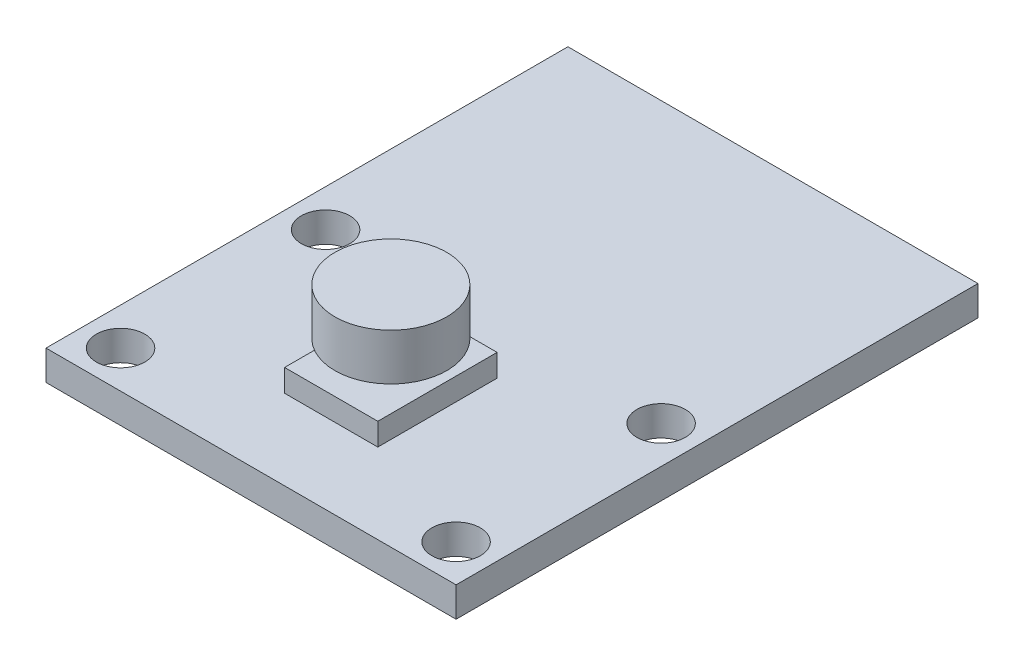
ISO-10303-21;
HEADER;
FILE_DESCRIPTION(('STEP AP214'),'2;1');
FILE_NAME('part.step','',(''),(''),'','','');
FILE_SCHEMA(('AUTOMOTIVE_DESIGN { 1 0 10303 214 1 1 1 1 }'));
ENDSEC;
DATA;
#1=APPLICATION_CONTEXT('core data for automotive mechanical design processes');
#2=APPLICATION_PROTOCOL_DEFINITION('international standard','automotive_design',2000,#1);
#3=PRODUCT_CONTEXT('',#1,'mechanical');
#4=PRODUCT('Part','Part','',(#3));
#5=PRODUCT_RELATED_PRODUCT_CATEGORY('part','',(#4));
#6=PRODUCT_DEFINITION_FORMATION('','',#4);
#7=PRODUCT_DEFINITION_CONTEXT('part definition',#1,'design');
#8=PRODUCT_DEFINITION('design','',#6,#7);
#9=PRODUCT_DEFINITION_SHAPE('','',#8);
#10=(LENGTH_UNIT() NAMED_UNIT(*) SI_UNIT(.MILLI.,.METRE.));
#11=(NAMED_UNIT(*) PLANE_ANGLE_UNIT() SI_UNIT($,.RADIAN.));
#12=(NAMED_UNIT(*) SI_UNIT($,.STERADIAN.) SOLID_ANGLE_UNIT());
#13=UNCERTAINTY_MEASURE_WITH_UNIT(LENGTH_MEASURE(1.E-05),#10,'distance_accuracy_value','');
#14=(GEOMETRIC_REPRESENTATION_CONTEXT(3) GLOBAL_UNCERTAINTY_ASSIGNED_CONTEXT((#13)) GLOBAL_UNIT_ASSIGNED_CONTEXT((#10,
#11,#12)) REPRESENTATION_CONTEXT('',''));
#15=CARTESIAN_POINT('',(0.,0.,0.));
#16=DIRECTION('',(0.,0.,1.));
#17=DIRECTION('',(1.,0.,0.));
#18=AXIS2_PLACEMENT_3D('',#15,#16,#17);
#19=CARTESIAN_POINT('',(0.,6.3,0.));
#20=DIRECTION('',(0.,-1.,0.));
#21=DIRECTION('',(0.,0.,-1.));
#22=AXIS2_PLACEMENT_3D('',#19,#20,#21);
#23=CYLINDRICAL_SURFACE('',#22,3.);
#24=CARTESIAN_POINT('',(0.,6.3,0.));
#25=DIRECTION('',(0.,1.,0.));
#26=DIRECTION('',(0.,0.,1.));
#27=AXIS2_PLACEMENT_3D('',#24,#25,#26);
#28=CIRCLE('',#27,3.);
#29=CARTESIAN_POINT('',(0.,6.3,3.));
#30=VERTEX_POINT('',#29);
#31=EDGE_CURVE('E11',#30,#30,#28,.T.);
#32=ORIENTED_EDGE('',*,*,#31,.F.);
#33=EDGE_LOOP('',(#32));
#34=FACE_BOUND('',#33,.T.);
#35=CARTESIAN_POINT('',(0.,3.8,0.));
#36=DIRECTION('',(0.,1.,0.));
#37=DIRECTION('',(0.,0.,1.));
#38=AXIS2_PLACEMENT_3D('',#35,#36,#37);
#39=CIRCLE('',#38,3.);
#40=CARTESIAN_POINT('',(0.,3.8,3.));
#41=VERTEX_POINT('',#40);
#42=EDGE_CURVE('E48',#41,#41,#39,.T.);
#43=ORIENTED_EDGE('',*,*,#42,.T.);
#44=EDGE_LOOP('',(#43));
#45=FACE_BOUND('',#44,.T.);
#46=ADVANCED_FACE('F45',(#34,#45),#23,.T.);
#47=CARTESIAN_POINT('',(0.,6.3,0.));
#48=DIRECTION('',(0.,1.,0.));
#49=DIRECTION('',(0.,0.,1.));
#50=AXIS2_PLACEMENT_3D('',#47,#48,#49);
#51=PLANE('',#50);
#52=ORIENTED_EDGE('',*,*,#31,.T.);
#53=EDGE_LOOP('',(#52));
#54=FACE_BOUND('',#53,.T.);
#55=ADVANCED_FACE('F60',(#54),#51,.T.);
#56=CARTESIAN_POINT('',(0.,3.8,0.));
#57=DIRECTION('',(0.,1.,0.));
#58=DIRECTION('',(0.,0.,1.));
#59=AXIS2_PLACEMENT_3D('',#56,#57,#58);
#60=PLANE('',#59);
#61=ORIENTED_EDGE('',*,*,#42,.F.);
#62=EDGE_LOOP('',(#61));
#63=FACE_BOUND('',#62,.T.);
#64=ADVANCED_FACE('F58',(#63),#60,.F.);
#65=CLOSED_SHELL('',(#46,#55,#64));
#66=MANIFOLD_SOLID_BREP('B2',#65);
#67=CARTESIAN_POINT('',(0.,1.6,0.));
#68=DIRECTION('',(0.,1.,0.));
#69=DIRECTION('',(0.,0.,1.));
#70=AXIS2_PLACEMENT_3D('',#67,#68,#69);
#71=PLANE('',#70);
#72=CARTESIAN_POINT('',(9.,1.6,5.5));
#73=DIRECTION('',(0.,1.,0.));
#74=DIRECTION('',(0.,0.,1.));
#75=AXIS2_PLACEMENT_3D('',#72,#73,#74);
#76=CIRCLE('',#75,1.3);
#77=CARTESIAN_POINT('',(9.,1.6,6.8));
#78=VERTEX_POINT('',#77);
#79=EDGE_CURVE('E195',#78,#78,#76,.T.);
#80=ORIENTED_EDGE('',*,*,#79,.F.);
#81=EDGE_LOOP('',(#80));
#82=FACE_BOUND('',#81,.T.);
#83=CARTESIAN_POINT('',(-9.,1.6,-5.5));
#84=DIRECTION('',(0.,1.,0.));
#85=DIRECTION('',(0.,0.,1.));
#86=AXIS2_PLACEMENT_3D('',#83,#84,#85);
#87=CIRCLE('',#86,1.3);
#88=CARTESIAN_POINT('',(-9.,1.6,-4.2));
#89=VERTEX_POINT('',#88);
#90=EDGE_CURVE('E207',#89,#89,#87,.T.);
#91=ORIENTED_EDGE('',*,*,#90,.F.);
#92=EDGE_LOOP('',(#91));
#93=FACE_BOUND('',#92,.T.);
#94=DIRECTION('',(0.,0.,1.));
#95=VECTOR('',#94,1.);
#96=CARTESIAN_POINT('',(-11.,1.6,-20.5));
#97=LINE('',#96,#95);
#98=CARTESIAN_POINT('',(-11.,1.6,-20.5));
#99=VERTEX_POINT('',#98);
#100=CARTESIAN_POINT('',(-11.,1.6,7.5));
#101=VERTEX_POINT('',#100);
#102=EDGE_CURVE('E213',#99,#101,#97,.T.);
#103=ORIENTED_EDGE('',*,*,#102,.T.);
#104=DIRECTION('',(1.,0.,0.));
#105=VECTOR('',#104,1.);
#106=CARTESIAN_POINT('',(-11.,1.6,7.5));
#107=LINE('',#106,#105);
#108=CARTESIAN_POINT('',(11.,1.6,7.5));
#109=VERTEX_POINT('',#108);
#110=EDGE_CURVE('E137',#101,#109,#107,.T.);
#111=ORIENTED_EDGE('',*,*,#110,.T.);
#112=DIRECTION('',(0.,0.,-1.));
#113=VECTOR('',#112,1.);
#114=CARTESIAN_POINT('',(11.,1.6,-20.5));
#115=LINE('',#114,#113);
#116=CARTESIAN_POINT('',(11.,1.6,-20.5));
#117=VERTEX_POINT('',#116);
#118=EDGE_CURVE('E216',#109,#117,#115,.T.);
#119=ORIENTED_EDGE('',*,*,#118,.T.);
#120=DIRECTION('',(-1.,0.,0.));
#121=VECTOR('',#120,1.);
#122=CARTESIAN_POINT('',(-11.,1.6,-20.5));
#123=LINE('',#122,#121);
#124=EDGE_CURVE('E109',#117,#99,#123,.T.);
#125=ORIENTED_EDGE('',*,*,#124,.T.);
#126=EDGE_LOOP('',(#103,#111,#119,#125));
#127=FACE_BOUND('',#126,.T.);
#128=CARTESIAN_POINT('',(9.,1.6,-5.5));
#129=DIRECTION('',(0.,1.,0.));
#130=DIRECTION('',(0.,0.,1.));
#131=AXIS2_PLACEMENT_3D('',#128,#129,#130);
#132=CIRCLE('',#131,1.3);
#133=CARTESIAN_POINT('',(9.,1.6,-4.2));
#134=VERTEX_POINT('',#133);
#135=EDGE_CURVE('E201',#134,#134,#132,.T.);
#136=ORIENTED_EDGE('',*,*,#135,.F.);
#137=EDGE_LOOP('',(#136));
#138=FACE_BOUND('',#137,.T.);
#139=CARTESIAN_POINT('',(-9.,1.6,5.5));
#140=DIRECTION('',(0.,1.,0.));
#141=DIRECTION('',(0.,0.,1.));
#142=AXIS2_PLACEMENT_3D('',#139,#140,#141);
#143=CIRCLE('',#142,1.3);
#144=CARTESIAN_POINT('',(-9.,1.6,6.8));
#145=VERTEX_POINT('',#144);
#146=EDGE_CURVE('E187',#145,#145,#143,.T.);
#147=ORIENTED_EDGE('',*,*,#146,.F.);
#148=EDGE_LOOP('',(#147));
#149=FACE_BOUND('',#148,.T.);
#150=DIRECTION('',(1.,0.,0.));
#151=VECTOR('',#150,1.);
#152=CARTESIAN_POINT('',(-2.5,1.6,3.2));
#153=LINE('',#152,#151);
#154=CARTESIAN_POINT('',(-2.5,1.6,3.2));
#155=VERTEX_POINT('',#154);
#156=CARTESIAN_POINT('',(2.5,1.6,3.2));
#157=VERTEX_POINT('',#156);
#158=EDGE_CURVE('E383',#155,#157,#153,.T.);
#159=ORIENTED_EDGE('',*,*,#158,.F.);
#160=DIRECTION('',(0.,0.,1.));
#161=VECTOR('',#160,1.);
#162=CARTESIAN_POINT('',(-2.5,1.6,-3.2));
#163=LINE('',#162,#161);
#164=CARTESIAN_POINT('',(-2.5,1.6,-3.2));
#165=VERTEX_POINT('',#164);
#166=EDGE_CURVE('E182',#165,#155,#163,.T.);
#167=ORIENTED_EDGE('',*,*,#166,.F.);
#168=DIRECTION('',(-1.,0.,0.));
#169=VECTOR('',#168,1.);
#170=CARTESIAN_POINT('',(-2.5,1.6,-3.2));
#171=LINE('',#170,#169);
#172=CARTESIAN_POINT('',(2.5,1.6,-3.2));
#173=VERTEX_POINT('',#172);
#174=EDGE_CURVE('E178',#173,#165,#171,.T.);
#175=ORIENTED_EDGE('',*,*,#174,.F.);
#176=DIRECTION('',(0.,0.,-1.));
#177=VECTOR('',#176,1.);
#178=CARTESIAN_POINT('',(2.5,1.6,-3.2));
#179=LINE('',#178,#177);
#180=EDGE_CURVE('E380',#157,#173,#179,.T.);
#181=ORIENTED_EDGE('',*,*,#180,.F.);
#182=EDGE_LOOP('',(#159,#167,#175,#181));
#183=FACE_BOUND('',#182,.T.);
#184=ADVANCED_FACE('F85',(#82,#93,#127,#138,#149,#183),#71,.T.);
#185=CARTESIAN_POINT('',(0.,0.,0.));
#186=DIRECTION('',(0.,1.,0.));
#187=DIRECTION('',(0.,0.,1.));
#188=AXIS2_PLACEMENT_3D('',#185,#186,#187);
#189=PLANE('',#188);
#190=DIRECTION('',(0.,0.,1.));
#191=VECTOR('',#190,1.);
#192=CARTESIAN_POINT('',(-11.,0.,-20.5));
#193=LINE('',#192,#191);
#194=CARTESIAN_POINT('',(-11.,0.,-20.5));
#195=VERTEX_POINT('',#194);
#196=CARTESIAN_POINT('',(-11.,0.,7.5));
#197=VERTEX_POINT('',#196);
#198=EDGE_CURVE('E210',#195,#197,#193,.T.);
#199=ORIENTED_EDGE('',*,*,#198,.F.);
#200=DIRECTION('',(-1.,0.,0.));
#201=VECTOR('',#200,1.);
#202=CARTESIAN_POINT('',(-11.,0.,-20.5));
#203=LINE('',#202,#201);
#204=CARTESIAN_POINT('',(11.,0.,-20.5));
#205=VERTEX_POINT('',#204);
#206=EDGE_CURVE('E130',#205,#195,#203,.T.);
#207=ORIENTED_EDGE('',*,*,#206,.F.);
#208=DIRECTION('',(0.,0.,-1.));
#209=VECTOR('',#208,1.);
#210=CARTESIAN_POINT('',(11.,0.,-20.5));
#211=LINE('',#210,#209);
#212=CARTESIAN_POINT('',(11.,0.,7.5));
#213=VERTEX_POINT('',#212);
#214=EDGE_CURVE('E224',#213,#205,#211,.T.);
#215=ORIENTED_EDGE('',*,*,#214,.F.);
#216=DIRECTION('',(1.,0.,0.));
#217=VECTOR('',#216,1.);
#218=CARTESIAN_POINT('',(-11.,0.,7.5));
#219=LINE('',#218,#217);
#220=EDGE_CURVE('E222',#197,#213,#219,.T.);
#221=ORIENTED_EDGE('',*,*,#220,.F.);
#222=EDGE_LOOP('',(#199,#207,#215,#221));
#223=FACE_BOUND('',#222,.T.);
#224=CARTESIAN_POINT('',(-9.,0.,-5.5));
#225=DIRECTION('',(0.,1.,0.));
#226=DIRECTION('',(0.,0.,1.));
#227=AXIS2_PLACEMENT_3D('',#224,#225,#226);
#228=CIRCLE('',#227,1.3);
#229=CARTESIAN_POINT('',(-9.,0.,-4.2));
#230=VERTEX_POINT('',#229);
#231=EDGE_CURVE('E204',#230,#230,#228,.T.);
#232=ORIENTED_EDGE('',*,*,#231,.T.);
#233=EDGE_LOOP('',(#232));
#234=FACE_BOUND('',#233,.T.);
#235=CARTESIAN_POINT('',(9.,0.,-5.5));
#236=DIRECTION('',(0.,1.,0.));
#237=DIRECTION('',(0.,0.,1.));
#238=AXIS2_PLACEMENT_3D('',#235,#236,#237);
#239=CIRCLE('',#238,1.3);
#240=CARTESIAN_POINT('',(9.,0.,-4.2));
#241=VERTEX_POINT('',#240);
#242=EDGE_CURVE('E198',#241,#241,#239,.T.);
#243=ORIENTED_EDGE('',*,*,#242,.T.);
#244=EDGE_LOOP('',(#243));
#245=FACE_BOUND('',#244,.T.);
#246=CARTESIAN_POINT('',(9.,0.,5.5));
#247=DIRECTION('',(0.,1.,0.));
#248=DIRECTION('',(0.,0.,1.));
#249=AXIS2_PLACEMENT_3D('',#246,#247,#248);
#250=CIRCLE('',#249,1.3);
#251=CARTESIAN_POINT('',(9.,0.,6.8));
#252=VERTEX_POINT('',#251);
#253=EDGE_CURVE('E193',#252,#252,#250,.T.);
#254=ORIENTED_EDGE('',*,*,#253,.T.);
#255=EDGE_LOOP('',(#254));
#256=FACE_BOUND('',#255,.T.);
#257=CARTESIAN_POINT('',(-9.,0.,5.5));
#258=DIRECTION('',(0.,1.,0.));
#259=DIRECTION('',(0.,0.,1.));
#260=AXIS2_PLACEMENT_3D('',#257,#258,#259);
#261=CIRCLE('',#260,1.3);
#262=CARTESIAN_POINT('',(-9.,0.,6.8));
#263=VERTEX_POINT('',#262);
#264=EDGE_CURVE('E184',#263,#263,#261,.T.);
#265=ORIENTED_EDGE('',*,*,#264,.T.);
#266=EDGE_LOOP('',(#265));
#267=FACE_BOUND('',#266,.T.);
#268=ADVANCED_FACE('F237',(#223,#234,#245,#256,#267),#189,.F.);
#269=CARTESIAN_POINT('',(-11.,1.6,-20.5));
#270=DIRECTION('',(1.,0.,0.));
#271=DIRECTION('',(0.,0.,-1.));
#272=AXIS2_PLACEMENT_3D('',#269,#270,#271);
#273=PLANE('',#272);
#274=ORIENTED_EDGE('',*,*,#198,.T.);
#275=DIRECTION('',(0.,-1.,0.));
#276=VECTOR('',#275,1.);
#277=CARTESIAN_POINT('',(-11.,1.6,7.5));
#278=LINE('',#277,#276);
#279=EDGE_CURVE('E43',#101,#197,#278,.T.);
#280=ORIENTED_EDGE('',*,*,#279,.F.);
#281=ORIENTED_EDGE('',*,*,#102,.F.);
#282=DIRECTION('',(0.,-1.,0.));
#283=VECTOR('',#282,1.);
#284=CARTESIAN_POINT('',(-11.,1.6,-20.5));
#285=LINE('',#284,#283);
#286=EDGE_CURVE('E219',#99,#195,#285,.T.);
#287=ORIENTED_EDGE('',*,*,#286,.T.);
#288=EDGE_LOOP('',(#274,#280,#281,#287));
#289=FACE_BOUND('',#288,.T.);
#290=ADVANCED_FACE('F87',(#289),#273,.F.);
#291=CARTESIAN_POINT('',(-11.,1.6,7.5));
#292=DIRECTION('',(0.,0.,-1.));
#293=DIRECTION('',(-1.,0.,0.));
#294=AXIS2_PLACEMENT_3D('',#291,#292,#293);
#295=PLANE('',#294);
#296=ORIENTED_EDGE('',*,*,#220,.T.);
#297=DIRECTION('',(0.,-1.,0.));
#298=VECTOR('',#297,1.);
#299=CARTESIAN_POINT('',(11.,1.6,7.5));
#300=LINE('',#299,#298);
#301=EDGE_CURVE('E93',#109,#213,#300,.T.);
#302=ORIENTED_EDGE('',*,*,#301,.F.);
#303=ORIENTED_EDGE('',*,*,#110,.F.);
#304=ORIENTED_EDGE('',*,*,#279,.T.);
#305=EDGE_LOOP('',(#296,#302,#303,#304));
#306=FACE_BOUND('',#305,.T.);
#307=ADVANCED_FACE('F253',(#306),#295,.F.);
#308=CARTESIAN_POINT('',(11.,1.6,-20.5));
#309=DIRECTION('',(-1.,0.,0.));
#310=DIRECTION('',(0.,0.,1.));
#311=AXIS2_PLACEMENT_3D('',#308,#309,#310);
#312=PLANE('',#311);
#313=ORIENTED_EDGE('',*,*,#214,.T.);
#314=DIRECTION('',(0.,-1.,0.));
#315=VECTOR('',#314,1.);
#316=CARTESIAN_POINT('',(11.,1.6,-20.5));
#317=LINE('',#316,#315);
#318=EDGE_CURVE('E228',#117,#205,#317,.T.);
#319=ORIENTED_EDGE('',*,*,#318,.F.);
#320=ORIENTED_EDGE('',*,*,#118,.F.);
#321=ORIENTED_EDGE('',*,*,#301,.T.);
#322=EDGE_LOOP('',(#313,#319,#320,#321));
#323=FACE_BOUND('',#322,.T.);
#324=ADVANCED_FACE('F233',(#323),#312,.F.);
#325=CARTESIAN_POINT('',(-11.,1.6,-20.5));
#326=DIRECTION('',(0.,0.,1.));
#327=DIRECTION('',(1.,0.,0.));
#328=AXIS2_PLACEMENT_3D('',#325,#326,#327);
#329=PLANE('',#328);
#330=ORIENTED_EDGE('',*,*,#206,.T.);
#331=ORIENTED_EDGE('',*,*,#286,.F.);
#332=ORIENTED_EDGE('',*,*,#124,.F.);
#333=ORIENTED_EDGE('',*,*,#318,.T.);
#334=EDGE_LOOP('',(#330,#331,#332,#333));
#335=FACE_BOUND('',#334,.T.);
#336=ADVANCED_FACE('F242',(#335),#329,.F.);
#337=CARTESIAN_POINT('',(-9.,1.6,-5.5));
#338=DIRECTION('',(0.,-1.,0.));
#339=DIRECTION('',(0.,0.,-1.));
#340=AXIS2_PLACEMENT_3D('',#337,#338,#339);
#341=CYLINDRICAL_SURFACE('',#340,1.3);
#342=ORIENTED_EDGE('',*,*,#90,.T.);
#343=EDGE_LOOP('',(#342));
#344=FACE_BOUND('',#343,.T.);
#345=ORIENTED_EDGE('',*,*,#231,.F.);
#346=EDGE_LOOP('',(#345));
#347=FACE_BOUND('',#346,.T.);
#348=ADVANCED_FACE('F244',(#344,#347),#341,.F.);
#349=CARTESIAN_POINT('',(9.,1.6,-5.5));
#350=DIRECTION('',(0.,-1.,0.));
#351=DIRECTION('',(0.,0.,-1.));
#352=AXIS2_PLACEMENT_3D('',#349,#350,#351);
#353=CYLINDRICAL_SURFACE('',#352,1.3);
#354=ORIENTED_EDGE('',*,*,#135,.T.);
#355=EDGE_LOOP('',(#354));
#356=FACE_BOUND('',#355,.T.);
#357=ORIENTED_EDGE('',*,*,#242,.F.);
#358=EDGE_LOOP('',(#357));
#359=FACE_BOUND('',#358,.T.);
#360=ADVANCED_FACE('F250',(#356,#359),#353,.F.);
#361=CARTESIAN_POINT('',(9.,1.6,5.5));
#362=DIRECTION('',(0.,-1.,0.));
#363=DIRECTION('',(0.,0.,-1.));
#364=AXIS2_PLACEMENT_3D('',#361,#362,#363);
#365=CYLINDRICAL_SURFACE('',#364,1.3);
#366=ORIENTED_EDGE('',*,*,#79,.T.);
#367=EDGE_LOOP('',(#366));
#368=FACE_BOUND('',#367,.T.);
#369=ORIENTED_EDGE('',*,*,#253,.F.);
#370=EDGE_LOOP('',(#369));
#371=FACE_BOUND('',#370,.T.);
#372=ADVANCED_FACE('F267',(#368,#371),#365,.F.);
#373=CARTESIAN_POINT('',(-9.,1.6,5.5));
#374=DIRECTION('',(0.,-1.,0.));
#375=DIRECTION('',(0.,0.,-1.));
#376=AXIS2_PLACEMENT_3D('',#373,#374,#375);
#377=CYLINDRICAL_SURFACE('',#376,1.3);
#378=ORIENTED_EDGE('',*,*,#146,.T.);
#379=EDGE_LOOP('',(#378));
#380=FACE_BOUND('',#379,.T.);
#381=ORIENTED_EDGE('',*,*,#264,.F.);
#382=EDGE_LOOP('',(#381));
#383=FACE_BOUND('',#382,.T.);
#384=ADVANCED_FACE('F271',(#380,#383),#377,.F.);
#385=CARTESIAN_POINT('',(-2.5,2.8,-3.2));
#386=DIRECTION('',(1.,0.,0.));
#387=DIRECTION('',(0.,0.,-1.));
#388=AXIS2_PLACEMENT_3D('',#385,#386,#387);
#389=PLANE('',#388);
#390=ORIENTED_EDGE('',*,*,#166,.T.);
#391=DIRECTION('',(0.,-1.,0.));
#392=VECTOR('',#391,1.);
#393=CARTESIAN_POINT('',(-2.5,2.8,3.2));
#394=LINE('',#393,#392);
#395=CARTESIAN_POINT('',(-2.5,2.8,3.2));
#396=VERTEX_POINT('',#395);
#397=EDGE_CURVE('E163',#396,#155,#394,.T.);
#398=ORIENTED_EDGE('',*,*,#397,.F.);
#399=DIRECTION('',(0.,0.,1.));
#400=VECTOR('',#399,1.);
#401=CARTESIAN_POINT('',(-2.5,2.8,-3.2));
#402=LINE('',#401,#400);
#403=CARTESIAN_POINT('',(-2.5,2.8,-3.2));
#404=VERTEX_POINT('',#403);
#405=EDGE_CURVE('E170',#404,#396,#402,.T.);
#406=ORIENTED_EDGE('',*,*,#405,.F.);
#407=DIRECTION('',(0.,-1.,0.));
#408=VECTOR('',#407,1.);
#409=CARTESIAN_POINT('',(-2.5,2.8,-3.2));
#410=LINE('',#409,#408);
#411=EDGE_CURVE('E377',#404,#165,#410,.T.);
#412=ORIENTED_EDGE('',*,*,#411,.T.);
#413=EDGE_LOOP('',(#390,#398,#406,#412));
#414=FACE_BOUND('',#413,.T.);
#415=ADVANCED_FACE('F180',(#414),#389,.F.);
#416=CARTESIAN_POINT('',(-2.5,2.8,3.2));
#417=DIRECTION('',(0.,0.,-1.));
#418=DIRECTION('',(-1.,0.,0.));
#419=AXIS2_PLACEMENT_3D('',#416,#417,#418);
#420=PLANE('',#419);
#421=ORIENTED_EDGE('',*,*,#158,.T.);
#422=DIRECTION('',(0.,-1.,0.));
#423=VECTOR('',#422,1.);
#424=CARTESIAN_POINT('',(2.5,2.8,3.2));
#425=LINE('',#424,#423);
#426=CARTESIAN_POINT('',(2.5,2.8,3.2));
#427=VERTEX_POINT('',#426);
#428=EDGE_CURVE('E166',#427,#157,#425,.T.);
#429=ORIENTED_EDGE('',*,*,#428,.F.);
#430=DIRECTION('',(1.,0.,0.));
#431=VECTOR('',#430,1.);
#432=CARTESIAN_POINT('',(-2.5,2.8,3.2));
#433=LINE('',#432,#431);
#434=EDGE_CURVE('E159',#396,#427,#433,.T.);
#435=ORIENTED_EDGE('',*,*,#434,.F.);
#436=ORIENTED_EDGE('',*,*,#397,.T.);
#437=EDGE_LOOP('',(#421,#429,#435,#436));
#438=FACE_BOUND('',#437,.T.);
#439=ADVANCED_FACE('F161',(#438),#420,.F.);
#440=CARTESIAN_POINT('',(2.5,2.8,-3.2));
#441=DIRECTION('',(-1.,0.,0.));
#442=DIRECTION('',(0.,0.,1.));
#443=AXIS2_PLACEMENT_3D('',#440,#441,#442);
#444=PLANE('',#443);
#445=ORIENTED_EDGE('',*,*,#180,.T.);
#446=DIRECTION('',(0.,-1.,0.));
#447=VECTOR('',#446,1.);
#448=CARTESIAN_POINT('',(2.5,2.8,-3.2));
#449=LINE('',#448,#447);
#450=CARTESIAN_POINT('',(2.5,2.8,-3.2));
#451=VERTEX_POINT('',#450);
#452=EDGE_CURVE('E100',#451,#173,#449,.T.);
#453=ORIENTED_EDGE('',*,*,#452,.F.);
#454=DIRECTION('',(0.,0.,-1.));
#455=VECTOR('',#454,1.);
#456=CARTESIAN_POINT('',(2.5,2.8,-3.2));
#457=LINE('',#456,#455);
#458=EDGE_CURVE('E169',#427,#451,#457,.T.);
#459=ORIENTED_EDGE('',*,*,#458,.F.);
#460=ORIENTED_EDGE('',*,*,#428,.T.);
#461=EDGE_LOOP('',(#445,#453,#459,#460));
#462=FACE_BOUND('',#461,.T.);
#463=ADVANCED_FACE('F280',(#462),#444,.F.);
#464=CARTESIAN_POINT('',(-2.5,2.8,-3.2));
#465=DIRECTION('',(0.,0.,1.));
#466=DIRECTION('',(1.,0.,0.));
#467=AXIS2_PLACEMENT_3D('',#464,#465,#466);
#468=PLANE('',#467);
#469=ORIENTED_EDGE('',*,*,#174,.T.);
#470=ORIENTED_EDGE('',*,*,#411,.F.);
#471=DIRECTION('',(-1.,0.,0.));
#472=VECTOR('',#471,1.);
#473=CARTESIAN_POINT('',(-2.5,2.8,-3.2));
#474=LINE('',#473,#472);
#475=EDGE_CURVE('E174',#451,#404,#474,.T.);
#476=ORIENTED_EDGE('',*,*,#475,.F.);
#477=ORIENTED_EDGE('',*,*,#452,.T.);
#478=EDGE_LOOP('',(#469,#470,#476,#477));
#479=FACE_BOUND('',#478,.T.);
#480=ADVANCED_FACE('F283',(#479),#468,.F.);
#481=CARTESIAN_POINT('',(0.,2.8,0.));
#482=DIRECTION('',(0.,1.,0.));
#483=DIRECTION('',(0.,0.,1.));
#484=AXIS2_PLACEMENT_3D('',#481,#482,#483);
#485=PLANE('',#484);
#486=ORIENTED_EDGE('',*,*,#405,.T.);
#487=ORIENTED_EDGE('',*,*,#434,.T.);
#488=ORIENTED_EDGE('',*,*,#458,.T.);
#489=ORIENTED_EDGE('',*,*,#475,.T.);
#490=EDGE_LOOP('',(#486,#487,#488,#489));
#491=FACE_BOUND('',#490,.T.);
#492=ADVANCED_FACE('F173',(#491),#485,.T.);
#493=CLOSED_SHELL('',(#184,#268,#290,#307,#324,#336,#348,#360,#372,#384,#415,#439,#463,#480,#492));
#494=MANIFOLD_SOLID_BREP('B6',#493);
#495=ADVANCED_BREP_SHAPE_REPRESENTATION('',(#18,#66,#494),#14);
#496=SHAPE_DEFINITION_REPRESENTATION(#9,#495);
ENDSEC;
END-ISO-10303-21;
